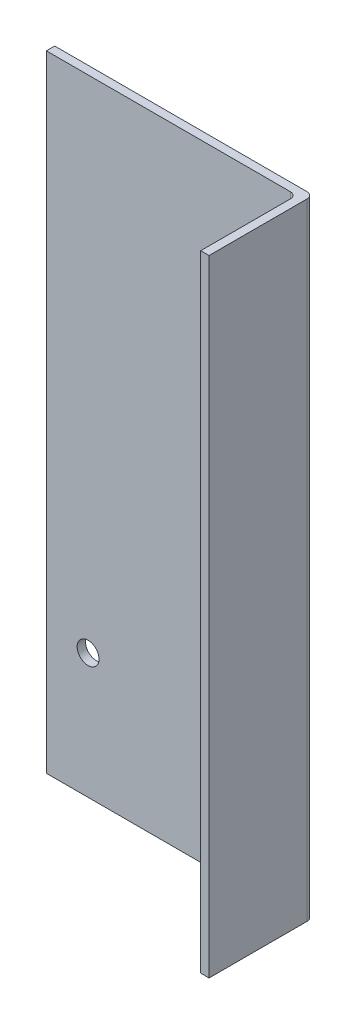
ISO-10303-21;
HEADER;
FILE_DESCRIPTION(('STEP AP214'),'2;1');
FILE_NAME('part.step','',(''),(''),'','','');
FILE_SCHEMA(('AUTOMOTIVE_DESIGN { 1 0 10303 214 1 1 1 1 }'));
ENDSEC;
DATA;
#1=APPLICATION_CONTEXT('core data for automotive mechanical design processes');
#2=APPLICATION_PROTOCOL_DEFINITION('international standard','automotive_design',2000,#1);
#3=PRODUCT_CONTEXT('',#1,'mechanical');
#4=PRODUCT('Part','Part','',(#3));
#5=PRODUCT_RELATED_PRODUCT_CATEGORY('part','',(#4));
#6=PRODUCT_DEFINITION_FORMATION('','',#4);
#7=PRODUCT_DEFINITION_CONTEXT('part definition',#1,'design');
#8=PRODUCT_DEFINITION('design','',#6,#7);
#9=PRODUCT_DEFINITION_SHAPE('','',#8);
#10=(LENGTH_UNIT() NAMED_UNIT(*) SI_UNIT(.MILLI.,.METRE.));
#11=(NAMED_UNIT(*) PLANE_ANGLE_UNIT() SI_UNIT($,.RADIAN.));
#12=(NAMED_UNIT(*) SI_UNIT($,.STERADIAN.) SOLID_ANGLE_UNIT());
#13=UNCERTAINTY_MEASURE_WITH_UNIT(LENGTH_MEASURE(1.E-05),#10,'distance_accuracy_value','');
#14=(GEOMETRIC_REPRESENTATION_CONTEXT(3) GLOBAL_UNCERTAINTY_ASSIGNED_CONTEXT((#13)) GLOBAL_UNIT_ASSIGNED_CONTEXT((#10,
#11,#12)) REPRESENTATION_CONTEXT('',''));
#15=CARTESIAN_POINT('',(0.,0.,0.));
#16=DIRECTION('',(0.,0.,1.));
#17=DIRECTION('',(1.,0.,0.));
#18=AXIS2_PLACEMENT_3D('',#15,#16,#17);
#19=CARTESIAN_POINT('',(64.,300.,0.));
#20=DIRECTION('',(1.,0.,0.));
#21=DIRECTION('',(0.,0.,-1.));
#22=AXIS2_PLACEMENT_3D('',#19,#20,#21);
#23=PLANE('',#22);
#24=DIRECTION('',(0.,0.,1.));
#25=VECTOR('',#24,1.);
#26=CARTESIAN_POINT('',(64.,0.,0.));
#27=LINE('',#26,#25);
#28=CARTESIAN_POINT('',(64.,0.,1.));
#29=VERTEX_POINT('',#28);
#30=CARTESIAN_POINT('',(64.,0.,48.));
#31=VERTEX_POINT('',#30);
#32=EDGE_CURVE('E137',#29,#31,#27,.T.);
#33=ORIENTED_EDGE('',*,*,#32,.F.);
#34=DIRECTION('',(0.,-1.,0.));
#35=VECTOR('',#34,1.);
#36=CARTESIAN_POINT('',(64.,300.,1.));
#37=LINE('',#36,#35);
#38=CARTESIAN_POINT('',(64.,300.,1.));
#39=VERTEX_POINT('',#38);
#40=EDGE_CURVE('E158',#29,#39,#37,.F.);
#41=ORIENTED_EDGE('',*,*,#40,.T.);
#42=DIRECTION('',(0.,0.,1.));
#43=VECTOR('',#42,1.);
#44=CARTESIAN_POINT('',(64.,300.,0.));
#45=LINE('',#44,#43);
#46=CARTESIAN_POINT('',(64.,300.,48.));
#47=VERTEX_POINT('',#46);
#48=EDGE_CURVE('E124',#39,#47,#45,.T.);
#49=ORIENTED_EDGE('',*,*,#48,.T.);
#50=DIRECTION('',(0.,-1.,0.));
#51=VECTOR('',#50,1.);
#52=CARTESIAN_POINT('',(64.,300.,48.));
#53=LINE('',#52,#51);
#54=EDGE_CURVE('E136',#47,#31,#53,.T.);
#55=ORIENTED_EDGE('',*,*,#54,.T.);
#56=EDGE_LOOP('',(#33,#41,#49,#55));
#57=FACE_BOUND('',#56,.T.);
#58=ADVANCED_FACE('F35',(#57),#23,.T.);
#59=CARTESIAN_POINT('',(0.,300.,-2.));
#60=DIRECTION('',(0.,0.,-1.));
#61=DIRECTION('',(-1.,0.,0.));
#62=AXIS2_PLACEMENT_3D('',#59,#60,#61);
#63=PLANE('',#62);
#64=CARTESIAN_POINT('',(40.,60.,-2.));
#65=DIRECTION('',(0.,0.,-1.));
#66=DIRECTION('',(-1.,0.,0.));
#67=AXIS2_PLACEMENT_3D('',#64,#65,#66);
#68=CIRCLE('',#67,5.25);
#69=CARTESIAN_POINT('',(34.75,60.,-2.));
#70=VERTEX_POINT('',#69);
#71=EDGE_CURVE('E221',#70,#70,#68,.F.);
#72=ORIENTED_EDGE('',*,*,#71,.T.);
#73=EDGE_LOOP('',(#72));
#74=FACE_BOUND('',#73,.T.);
#75=CARTESIAN_POINT('',(-40.,60.,-2.));
#76=DIRECTION('',(0.,0.,-1.));
#77=DIRECTION('',(-1.,0.,0.));
#78=AXIS2_PLACEMENT_3D('',#75,#76,#77);
#79=CIRCLE('',#78,5.25);
#80=CARTESIAN_POINT('',(-45.25,60.,-2.));
#81=VERTEX_POINT('',#80);
#82=EDGE_CURVE('E225',#81,#81,#79,.F.);
#83=ORIENTED_EDGE('',*,*,#82,.T.);
#84=EDGE_LOOP('',(#83));
#85=FACE_BOUND('',#84,.T.);
#86=DIRECTION('',(1.,0.,0.));
#87=VECTOR('',#86,1.);
#88=CARTESIAN_POINT('',(0.,300.,-2.));
#89=LINE('',#88,#87);
#90=CARTESIAN_POINT('',(-60.,300.,-2.));
#91=VERTEX_POINT('',#90);
#92=CARTESIAN_POINT('',(61.,300.,-2.));
#93=VERTEX_POINT('',#92);
#94=EDGE_CURVE('E105',#91,#93,#89,.T.);
#95=ORIENTED_EDGE('',*,*,#94,.T.);
#96=DIRECTION('',(0.,-1.,0.));
#97=VECTOR('',#96,1.);
#98=CARTESIAN_POINT('',(61.,300.,-2.));
#99=LINE('',#98,#97);
#100=CARTESIAN_POINT('',(61.,0.,-2.));
#101=VERTEX_POINT('',#100);
#102=EDGE_CURVE('E111',#93,#101,#99,.T.);
#103=ORIENTED_EDGE('',*,*,#102,.T.);
#104=DIRECTION('',(1.,0.,0.));
#105=VECTOR('',#104,1.);
#106=CARTESIAN_POINT('',(0.,0.,-2.));
#107=LINE('',#106,#105);
#108=CARTESIAN_POINT('',(-60.,0.,-2.));
#109=VERTEX_POINT('',#108);
#110=EDGE_CURVE('E108',#109,#101,#107,.T.);
#111=ORIENTED_EDGE('',*,*,#110,.F.);
#112=DIRECTION('',(0.,-1.,0.));
#113=VECTOR('',#112,1.);
#114=CARTESIAN_POINT('',(-60.,300.,-2.));
#115=LINE('',#114,#113);
#116=EDGE_CURVE('E100',#91,#109,#115,.T.);
#117=ORIENTED_EDGE('',*,*,#116,.F.);
#118=EDGE_LOOP('',(#95,#103,#111,#117));
#119=FACE_BOUND('',#118,.T.);
#120=ADVANCED_FACE('F102',(#74,#85,#119),#63,.T.);
#121=CARTESIAN_POINT('',(-60.,300.,0.));
#122=DIRECTION('',(1.,0.,0.));
#123=DIRECTION('',(0.,0.,-1.));
#124=AXIS2_PLACEMENT_3D('',#121,#122,#123);
#125=PLANE('',#124);
#126=DIRECTION('',(0.,0.,1.));
#127=VECTOR('',#126,1.);
#128=CARTESIAN_POINT('',(-60.,0.,0.));
#129=LINE('',#128,#127);
#130=CARTESIAN_POINT('',(-60.,0.,2.));
#131=VERTEX_POINT('',#130);
#132=EDGE_CURVE('E141',#109,#131,#129,.T.);
#133=ORIENTED_EDGE('',*,*,#132,.T.);
#134=DIRECTION('',(0.,-1.,0.));
#135=VECTOR('',#134,1.);
#136=CARTESIAN_POINT('',(-60.,300.,2.));
#137=LINE('',#136,#135);
#138=CARTESIAN_POINT('',(-60.,300.,2.));
#139=VERTEX_POINT('',#138);
#140=EDGE_CURVE('E112',#139,#131,#137,.T.);
#141=ORIENTED_EDGE('',*,*,#140,.F.);
#142=DIRECTION('',(0.,0.,1.));
#143=VECTOR('',#142,1.);
#144=CARTESIAN_POINT('',(-60.,300.,0.));
#145=LINE('',#144,#143);
#146=EDGE_CURVE('E115',#91,#139,#145,.T.);
#147=ORIENTED_EDGE('',*,*,#146,.F.);
#148=ORIENTED_EDGE('',*,*,#116,.T.);
#149=EDGE_LOOP('',(#133,#141,#147,#148));
#150=FACE_BOUND('',#149,.T.);
#151=ADVANCED_FACE('F116',(#150),#125,.F.);
#152=CARTESIAN_POINT('',(0.,300.,2.));
#153=DIRECTION('',(0.,0.,-1.));
#154=DIRECTION('',(-1.,0.,0.));
#155=AXIS2_PLACEMENT_3D('',#152,#153,#154);
#156=PLANE('',#155);
#157=CARTESIAN_POINT('',(40.,60.,2.));
#158=DIRECTION('',(0.,0.,1.));
#159=DIRECTION('',(-1.,0.,0.));
#160=AXIS2_PLACEMENT_3D('',#157,#158,#159);
#161=CIRCLE('',#160,5.25);
#162=CARTESIAN_POINT('',(34.75,60.,2.));
#163=VERTEX_POINT('',#162);
#164=EDGE_CURVE('E224',#163,#163,#161,.T.);
#165=ORIENTED_EDGE('',*,*,#164,.F.);
#166=EDGE_LOOP('',(#165));
#167=FACE_BOUND('',#166,.T.);
#168=CARTESIAN_POINT('',(-40.,60.,2.));
#169=DIRECTION('',(0.,0.,1.));
#170=DIRECTION('',(1.,0.,0.));
#171=AXIS2_PLACEMENT_3D('',#168,#169,#170);
#172=CIRCLE('',#171,5.25);
#173=CARTESIAN_POINT('',(-34.75,60.,2.));
#174=VERTEX_POINT('',#173);
#175=EDGE_CURVE('E139',#174,#174,#172,.T.);
#176=ORIENTED_EDGE('',*,*,#175,.F.);
#177=EDGE_LOOP('',(#176));
#178=FACE_BOUND('',#177,.T.);
#179=DIRECTION('',(1.,0.,0.));
#180=VECTOR('',#179,1.);
#181=CARTESIAN_POINT('',(0.,0.,2.));
#182=LINE('',#181,#180);
#183=CARTESIAN_POINT('',(57.,0.,2.));
#184=VERTEX_POINT('',#183);
#185=EDGE_CURVE('E143',#131,#184,#182,.T.);
#186=ORIENTED_EDGE('',*,*,#185,.T.);
#187=DIRECTION('',(0.,-1.,0.));
#188=VECTOR('',#187,1.);
#189=CARTESIAN_POINT('',(57.,300.,2.));
#190=LINE('',#189,#188);
#191=CARTESIAN_POINT('',(57.,300.,2.));
#192=VERTEX_POINT('',#191);
#193=EDGE_CURVE('E56',#184,#192,#190,.F.);
#194=ORIENTED_EDGE('',*,*,#193,.T.);
#195=DIRECTION('',(1.,0.,0.));
#196=VECTOR('',#195,1.);
#197=CARTESIAN_POINT('',(0.,300.,2.));
#198=LINE('',#197,#196);
#199=EDGE_CURVE('E118',#139,#192,#198,.T.);
#200=ORIENTED_EDGE('',*,*,#199,.F.);
#201=ORIENTED_EDGE('',*,*,#140,.T.);
#202=EDGE_LOOP('',(#186,#194,#200,#201));
#203=FACE_BOUND('',#202,.T.);
#204=ADVANCED_FACE('F171',(#167,#178,#203),#156,.F.);
#205=CARTESIAN_POINT('',(60.,300.,0.));
#206=DIRECTION('',(1.,0.,0.));
#207=DIRECTION('',(0.,0.,-1.));
#208=AXIS2_PLACEMENT_3D('',#205,#206,#207);
#209=PLANE('',#208);
#210=DIRECTION('',(0.,0.,1.));
#211=VECTOR('',#210,1.);
#212=CARTESIAN_POINT('',(60.,300.,0.));
#213=LINE('',#212,#211);
#214=CARTESIAN_POINT('',(60.,300.,5.));
#215=VERTEX_POINT('',#214);
#216=CARTESIAN_POINT('',(60.,300.,48.));
#217=VERTEX_POINT('',#216);
#218=EDGE_CURVE('E131',#215,#217,#213,.T.);
#219=ORIENTED_EDGE('',*,*,#218,.F.);
#220=DIRECTION('',(0.,-1.,0.));
#221=VECTOR('',#220,1.);
#222=CARTESIAN_POINT('',(60.,0.,5.));
#223=LINE('',#222,#221);
#224=CARTESIAN_POINT('',(60.,0.,5.));
#225=VERTEX_POINT('',#224);
#226=EDGE_CURVE('E161',#215,#225,#223,.T.);
#227=ORIENTED_EDGE('',*,*,#226,.T.);
#228=DIRECTION('',(0.,0.,1.));
#229=VECTOR('',#228,1.);
#230=CARTESIAN_POINT('',(60.,0.,0.));
#231=LINE('',#230,#229);
#232=CARTESIAN_POINT('',(60.,0.,48.));
#233=VERTEX_POINT('',#232);
#234=EDGE_CURVE('E145',#225,#233,#231,.T.);
#235=ORIENTED_EDGE('',*,*,#234,.T.);
#236=DIRECTION('',(0.,-1.,0.));
#237=VECTOR('',#236,1.);
#238=CARTESIAN_POINT('',(60.,300.,48.));
#239=LINE('',#238,#237);
#240=EDGE_CURVE('E151',#217,#233,#239,.T.);
#241=ORIENTED_EDGE('',*,*,#240,.F.);
#242=EDGE_LOOP('',(#219,#227,#235,#241));
#243=FACE_BOUND('',#242,.T.);
#244=ADVANCED_FACE('F173',(#243),#209,.F.);
#245=CARTESIAN_POINT('',(0.,300.,48.));
#246=DIRECTION('',(0.,0.,-1.));
#247=DIRECTION('',(-1.,0.,0.));
#248=AXIS2_PLACEMENT_3D('',#245,#246,#247);
#249=PLANE('',#248);
#250=DIRECTION('',(1.,0.,0.));
#251=VECTOR('',#250,1.);
#252=CARTESIAN_POINT('',(0.,0.,48.));
#253=LINE('',#252,#251);
#254=EDGE_CURVE('E126',#233,#31,#253,.T.);
#255=ORIENTED_EDGE('',*,*,#254,.T.);
#256=ORIENTED_EDGE('',*,*,#54,.F.);
#257=DIRECTION('',(1.,0.,0.));
#258=VECTOR('',#257,1.);
#259=CARTESIAN_POINT('',(0.,300.,48.));
#260=LINE('',#259,#258);
#261=EDGE_CURVE('E133',#217,#47,#260,.T.);
#262=ORIENTED_EDGE('',*,*,#261,.F.);
#263=ORIENTED_EDGE('',*,*,#240,.T.);
#264=EDGE_LOOP('',(#255,#256,#262,#263));
#265=FACE_BOUND('',#264,.T.);
#266=ADVANCED_FACE('F178',(#265),#249,.F.);
#267=CARTESIAN_POINT('',(0.,300.,0.));
#268=DIRECTION('',(0.,1.,0.));
#269=DIRECTION('',(0.,0.,1.));
#270=AXIS2_PLACEMENT_3D('',#267,#268,#269);
#271=PLANE('',#270);
#272=ORIENTED_EDGE('',*,*,#48,.F.);
#273=CARTESIAN_POINT('',(61.,300.,1.));
#274=DIRECTION('',(0.,1.,0.));
#275=DIRECTION('',(0.,0.,1.));
#276=AXIS2_PLACEMENT_3D('',#273,#274,#275);
#277=CIRCLE('',#276,3.);
#278=EDGE_CURVE('E123',#39,#93,#277,.T.);
#279=ORIENTED_EDGE('',*,*,#278,.T.);
#280=ORIENTED_EDGE('',*,*,#94,.F.);
#281=ORIENTED_EDGE('',*,*,#146,.T.);
#282=ORIENTED_EDGE('',*,*,#199,.T.);
#283=CARTESIAN_POINT('',(57.,300.,5.));
#284=DIRECTION('',(0.,1.,0.));
#285=DIRECTION('',(0.,0.,1.));
#286=AXIS2_PLACEMENT_3D('',#283,#284,#285);
#287=CIRCLE('',#286,3.);
#288=EDGE_CURVE('E11',#192,#215,#287,.F.);
#289=ORIENTED_EDGE('',*,*,#288,.T.);
#290=ORIENTED_EDGE('',*,*,#218,.T.);
#291=ORIENTED_EDGE('',*,*,#261,.T.);
#292=EDGE_LOOP('',(#272,#279,#280,#281,#282,#289,#290,#291));
#293=FACE_BOUND('',#292,.T.);
#294=ADVANCED_FACE('F121',(#293),#271,.T.);
#295=CARTESIAN_POINT('',(0.,0.,0.));
#296=DIRECTION('',(0.,1.,0.));
#297=DIRECTION('',(0.,0.,1.));
#298=AXIS2_PLACEMENT_3D('',#295,#296,#297);
#299=PLANE('',#298);
#300=ORIENTED_EDGE('',*,*,#110,.T.);
#301=CARTESIAN_POINT('',(61.,0.,1.));
#302=DIRECTION('',(0.,1.,0.));
#303=DIRECTION('',(0.,0.,1.));
#304=AXIS2_PLACEMENT_3D('',#301,#302,#303);
#305=CIRCLE('',#304,3.);
#306=EDGE_CURVE('E156',#101,#29,#305,.F.);
#307=ORIENTED_EDGE('',*,*,#306,.T.);
#308=ORIENTED_EDGE('',*,*,#32,.T.);
#309=ORIENTED_EDGE('',*,*,#254,.F.);
#310=ORIENTED_EDGE('',*,*,#234,.F.);
#311=CARTESIAN_POINT('',(57.,0.,5.));
#312=DIRECTION('',(0.,1.,0.));
#313=DIRECTION('',(0.,0.,1.));
#314=AXIS2_PLACEMENT_3D('',#311,#312,#313);
#315=CIRCLE('',#314,3.);
#316=EDGE_CURVE('E43',#225,#184,#315,.T.);
#317=ORIENTED_EDGE('',*,*,#316,.T.);
#318=ORIENTED_EDGE('',*,*,#185,.F.);
#319=ORIENTED_EDGE('',*,*,#132,.F.);
#320=EDGE_LOOP('',(#300,#307,#308,#309,#310,#317,#318,#319));
#321=FACE_BOUND('',#320,.T.);
#322=ADVANCED_FACE('F167',(#321),#299,.F.);
#323=CARTESIAN_POINT('',(61.,300.,1.));
#324=DIRECTION('',(0.,-1.,0.));
#325=DIRECTION('',(0.,0.,-1.));
#326=AXIS2_PLACEMENT_3D('',#323,#324,#325);
#327=CYLINDRICAL_SURFACE('',#326,3.);
#328=ORIENTED_EDGE('',*,*,#278,.F.);
#329=ORIENTED_EDGE('',*,*,#40,.F.);
#330=ORIENTED_EDGE('',*,*,#306,.F.);
#331=ORIENTED_EDGE('',*,*,#102,.F.);
#332=EDGE_LOOP('',(#328,#329,#330,#331));
#333=FACE_BOUND('',#332,.T.);
#334=ADVANCED_FACE('F183',(#333),#327,.T.);
#335=CARTESIAN_POINT('',(57.,300.,5.));
#336=DIRECTION('',(0.,1.,0.));
#337=DIRECTION('',(0.,0.,1.));
#338=AXIS2_PLACEMENT_3D('',#335,#336,#337);
#339=CYLINDRICAL_SURFACE('',#338,3.);
#340=ORIENTED_EDGE('',*,*,#288,.F.);
#341=ORIENTED_EDGE('',*,*,#193,.F.);
#342=ORIENTED_EDGE('',*,*,#316,.F.);
#343=ORIENTED_EDGE('',*,*,#226,.F.);
#344=EDGE_LOOP('',(#340,#341,#342,#343));
#345=FACE_BOUND('',#344,.T.);
#346=ADVANCED_FACE('F37',(#345),#339,.F.);
#347=CARTESIAN_POINT('',(-40.,60.,-2.001));
#348=DIRECTION('',(0.,0.,1.));
#349=DIRECTION('',(1.,0.,0.));
#350=AXIS2_PLACEMENT_3D('',#347,#348,#349);
#351=CYLINDRICAL_SURFACE('',#350,5.25);
#352=ORIENTED_EDGE('',*,*,#82,.F.);
#353=EDGE_LOOP('',(#352));
#354=FACE_BOUND('',#353,.T.);
#355=ORIENTED_EDGE('',*,*,#175,.T.);
#356=EDGE_LOOP('',(#355));
#357=FACE_BOUND('',#356,.T.);
#358=ADVANCED_FACE('F189',(#354,#357),#351,.F.);
#359=CARTESIAN_POINT('',(40.,60.,-2.001));
#360=DIRECTION('',(0.,0.,1.));
#361=DIRECTION('',(1.,0.,0.));
#362=AXIS2_PLACEMENT_3D('',#359,#360,#361);
#363=CYLINDRICAL_SURFACE('',#362,5.25);
#364=ORIENTED_EDGE('',*,*,#71,.F.);
#365=EDGE_LOOP('',(#364));
#366=FACE_BOUND('',#365,.T.);
#367=ORIENTED_EDGE('',*,*,#164,.T.);
#368=EDGE_LOOP('',(#367));
#369=FACE_BOUND('',#368,.T.);
#370=ADVANCED_FACE('F212',(#366,#369),#363,.F.);
#371=CLOSED_SHELL('',(#58,#120,#151,#204,#244,#266,#294,#322,#334,#346,#358,#370));
#372=MANIFOLD_SOLID_BREP('B2',#371);
#373=ADVANCED_BREP_SHAPE_REPRESENTATION('',(#18,#372),#14);
#374=SHAPE_DEFINITION_REPRESENTATION(#9,#373);
ENDSEC;
END-ISO-10303-21;
